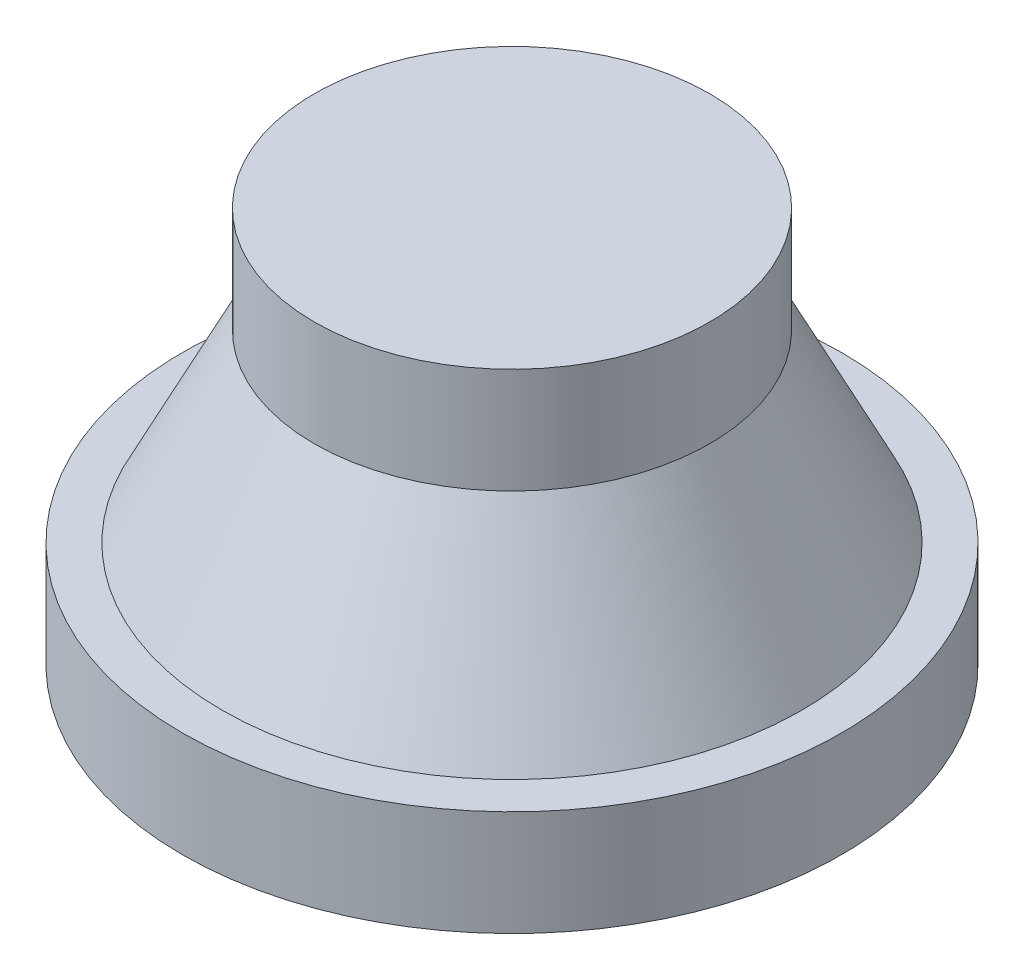
ISO-10303-21;
HEADER;
FILE_DESCRIPTION(('STEP AP214'),'2;1');
FILE_NAME('part.step','',(''),(''),'','','');
FILE_SCHEMA(('AUTOMOTIVE_DESIGN { 1 0 10303 214 1 1 1 1 }'));
ENDSEC;
DATA;
#1=APPLICATION_CONTEXT('core data for automotive mechanical design processes');
#2=APPLICATION_PROTOCOL_DEFINITION('international standard','automotive_design',2000,#1);
#3=PRODUCT_CONTEXT('',#1,'mechanical');
#4=PRODUCT('Part','Part','',(#3));
#5=PRODUCT_RELATED_PRODUCT_CATEGORY('part','',(#4));
#6=PRODUCT_DEFINITION_FORMATION('','',#4);
#7=PRODUCT_DEFINITION_CONTEXT('part definition',#1,'design');
#8=PRODUCT_DEFINITION('design','',#6,#7);
#9=PRODUCT_DEFINITION_SHAPE('','',#8);
#10=(LENGTH_UNIT() NAMED_UNIT(*) SI_UNIT(.MILLI.,.METRE.));
#11=(NAMED_UNIT(*) PLANE_ANGLE_UNIT() SI_UNIT($,.RADIAN.));
#12=(NAMED_UNIT(*) SI_UNIT($,.STERADIAN.) SOLID_ANGLE_UNIT());
#13=UNCERTAINTY_MEASURE_WITH_UNIT(LENGTH_MEASURE(1.E-05),#10,'distance_accuracy_value','');
#14=(GEOMETRIC_REPRESENTATION_CONTEXT(3) GLOBAL_UNCERTAINTY_ASSIGNED_CONTEXT((#13)) GLOBAL_UNIT_ASSIGNED_CONTEXT((#10,
#11,#12)) REPRESENTATION_CONTEXT('',''));
#15=CARTESIAN_POINT('',(0.,0.,0.));
#16=DIRECTION('',(0.,0.,1.));
#17=DIRECTION('',(1.,0.,0.));
#18=AXIS2_PLACEMENT_3D('',#15,#16,#17);
#19=CARTESIAN_POINT('',(0.,15.,0.));
#20=DIRECTION('',(0.,-1.,0.));
#21=DIRECTION('',(0.,0.,-1.));
#22=AXIS2_PLACEMENT_3D('',#19,#20,#21);
#23=CYLINDRICAL_SURFACE('',#22,12.5);
#24=CARTESIAN_POINT('',(0.,4.,0.));
#25=DIRECTION('',(0.,1.,0.));
#26=DIRECTION('',(0.,0.,1.));
#27=AXIS2_PLACEMENT_3D('',#24,#25,#26);
#28=CIRCLE('',#27,12.5);
#29=CARTESIAN_POINT('',(0.,4.,12.5));
#30=VERTEX_POINT('',#29);
#31=EDGE_CURVE('E37',#30,#30,#28,.T.);
#32=ORIENTED_EDGE('',*,*,#31,.F.);
#33=EDGE_LOOP('',(#32));
#34=FACE_BOUND('',#33,.T.);
#35=CARTESIAN_POINT('',(0.,0.,0.));
#36=DIRECTION('',(0.,1.,0.));
#37=DIRECTION('',(0.,0.,1.));
#38=AXIS2_PLACEMENT_3D('',#35,#36,#37);
#39=CIRCLE('',#38,12.5);
#40=CARTESIAN_POINT('',(0.,0.,12.5));
#41=VERTEX_POINT('',#40);
#42=EDGE_CURVE('E10',#41,#41,#39,.T.);
#43=ORIENTED_EDGE('',*,*,#42,.T.);
#44=EDGE_LOOP('',(#43));
#45=FACE_BOUND('',#44,.T.);
#46=ADVANCED_FACE('F31',(#34,#45),#23,.T.);
#47=CARTESIAN_POINT('',(0.,0.,0.));
#48=DIRECTION('',(0.,1.,0.));
#49=DIRECTION('',(0.,0.,1.));
#50=AXIS2_PLACEMENT_3D('',#47,#48,#49);
#51=PLANE('',#50);
#52=ORIENTED_EDGE('',*,*,#42,.F.);
#53=EDGE_LOOP('',(#52));
#54=FACE_BOUND('',#53,.T.);
#55=ADVANCED_FACE('F70',(#54),#51,.F.);
#56=CARTESIAN_POINT('',(-12.5,4.,0.));
#57=DIRECTION('',(0.,-1.,0.));
#58=DIRECTION('',(0.,0.,-1.));
#59=AXIS2_PLACEMENT_3D('',#56,#57,#58);
#60=PLANE('',#59);
#61=CARTESIAN_POINT('',(0.,4.,0.));
#62=DIRECTION('',(0.,1.,0.));
#63=DIRECTION('',(0.,0.,1.));
#64=AXIS2_PLACEMENT_3D('',#61,#62,#63);
#65=CIRCLE('',#64,11.);
#66=CARTESIAN_POINT('',(0.,4.,11.));
#67=VERTEX_POINT('',#66);
#68=EDGE_CURVE('E41',#67,#67,#65,.T.);
#69=ORIENTED_EDGE('',*,*,#68,.F.);
#70=EDGE_LOOP('',(#69));
#71=FACE_BOUND('',#70,.T.);
#72=ORIENTED_EDGE('',*,*,#31,.T.);
#73=EDGE_LOOP('',(#72));
#74=FACE_BOUND('',#73,.T.);
#75=ADVANCED_FACE('F65',(#71,#74),#60,.F.);
#76=CARTESIAN_POINT('',(0.,4.,0.));
#77=DIRECTION('',(0.,-1.,0.));
#78=DIRECTION('',(0.,0.,-1.));
#79=AXIS2_PLACEMENT_3D('',#76,#77,#78);
#80=CONICAL_SURFACE('',#79,11.,0.463647609000806);
#81=CARTESIAN_POINT('',(0.,11.,0.));
#82=DIRECTION('',(0.,1.,0.));
#83=DIRECTION('',(0.,0.,1.));
#84=AXIS2_PLACEMENT_3D('',#81,#82,#83);
#85=CIRCLE('',#84,7.5);
#86=CARTESIAN_POINT('',(0.,11.,7.5));
#87=VERTEX_POINT('',#86);
#88=EDGE_CURVE('E45',#87,#87,#85,.T.);
#89=ORIENTED_EDGE('',*,*,#88,.F.);
#90=EDGE_LOOP('',(#89));
#91=FACE_BOUND('',#90,.T.);
#92=ORIENTED_EDGE('',*,*,#68,.T.);
#93=EDGE_LOOP('',(#92));
#94=FACE_BOUND('',#93,.T.);
#95=ADVANCED_FACE('F59',(#91,#94),#80,.T.);
#96=CARTESIAN_POINT('',(0.,15.,0.));
#97=DIRECTION('',(0.,1.,0.));
#98=DIRECTION('',(0.,0.,1.));
#99=AXIS2_PLACEMENT_3D('',#96,#97,#98);
#100=CYLINDRICAL_SURFACE('',#99,7.5);
#101=CARTESIAN_POINT('',(0.,15.,0.));
#102=DIRECTION('',(0.,1.,0.));
#103=DIRECTION('',(0.,0.,1.));
#104=AXIS2_PLACEMENT_3D('',#101,#102,#103);
#105=CIRCLE('',#104,7.5);
#106=CARTESIAN_POINT('',(0.,15.,7.5));
#107=VERTEX_POINT('',#106);
#108=EDGE_CURVE('E50',#107,#107,#105,.T.);
#109=ORIENTED_EDGE('',*,*,#108,.F.);
#110=EDGE_LOOP('',(#109));
#111=FACE_BOUND('',#110,.T.);
#112=ORIENTED_EDGE('',*,*,#88,.T.);
#113=EDGE_LOOP('',(#112));
#114=FACE_BOUND('',#113,.T.);
#115=ADVANCED_FACE('F56',(#111,#114),#100,.T.);
#116=CARTESIAN_POINT('',(0.,15.,0.));
#117=DIRECTION('',(0.,1.,0.));
#118=DIRECTION('',(0.,0.,1.));
#119=AXIS2_PLACEMENT_3D('',#116,#117,#118);
#120=PLANE('',#119);
#121=ORIENTED_EDGE('',*,*,#108,.T.);
#122=EDGE_LOOP('',(#121));
#123=FACE_BOUND('',#122,.T.);
#124=ADVANCED_FACE('F54',(#123),#120,.T.);
#125=CLOSED_SHELL('',(#46,#55,#75,#95,#115,#124));
#126=MANIFOLD_SOLID_BREP('B2',#125);
#127=ADVANCED_BREP_SHAPE_REPRESENTATION('',(#18,#126),#14);
#128=SHAPE_DEFINITION_REPRESENTATION(#9,#127);
ENDSEC;
END-ISO-10303-21;
